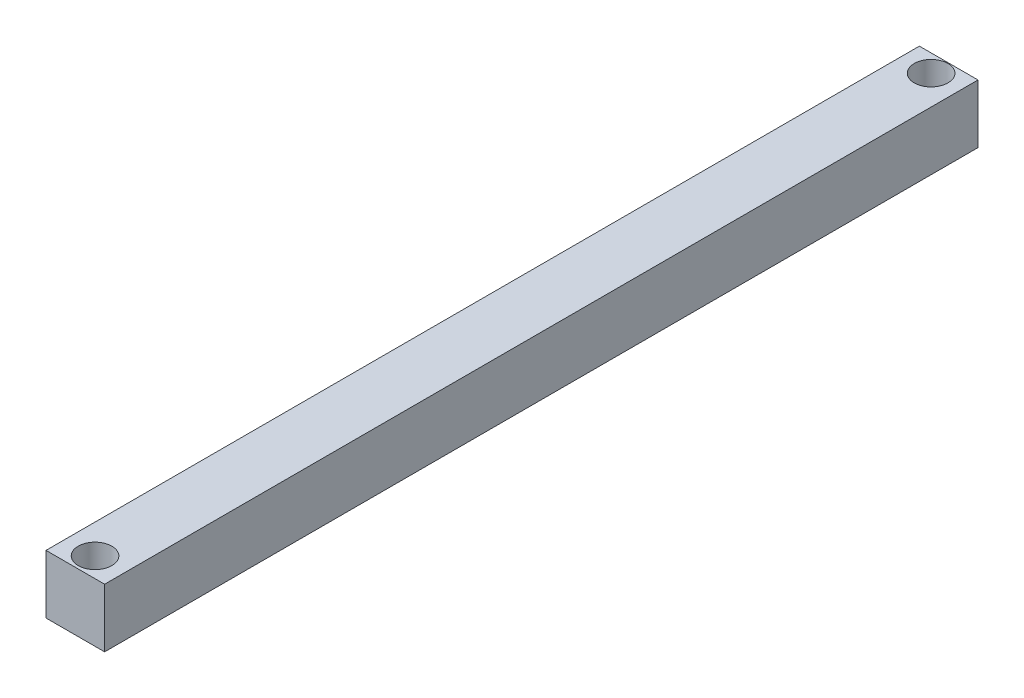
ISO-10303-21;
HEADER;
FILE_DESCRIPTION(('STEP AP214'),'2;1');
FILE_NAME('part.step','',(''),(''),'','','');
FILE_SCHEMA(('AUTOMOTIVE_DESIGN { 1 0 10303 214 1 1 1 1 }'));
ENDSEC;
DATA;
#1=APPLICATION_CONTEXT('core data for automotive mechanical design processes');
#2=APPLICATION_PROTOCOL_DEFINITION('international standard','automotive_design',2000,#1);
#3=PRODUCT_CONTEXT('',#1,'mechanical');
#4=PRODUCT('Part','Part','',(#3));
#5=PRODUCT_RELATED_PRODUCT_CATEGORY('part','',(#4));
#6=PRODUCT_DEFINITION_FORMATION('','',#4);
#7=PRODUCT_DEFINITION_CONTEXT('part definition',#1,'design');
#8=PRODUCT_DEFINITION('design','',#6,#7);
#9=PRODUCT_DEFINITION_SHAPE('','',#8);
#10=(LENGTH_UNIT() NAMED_UNIT(*) SI_UNIT(.MILLI.,.METRE.));
#11=(NAMED_UNIT(*) PLANE_ANGLE_UNIT() SI_UNIT($,.RADIAN.));
#12=(NAMED_UNIT(*) SI_UNIT($,.STERADIAN.) SOLID_ANGLE_UNIT());
#13=UNCERTAINTY_MEASURE_WITH_UNIT(LENGTH_MEASURE(1.E-05),#10,'distance_accuracy_value','');
#14=(GEOMETRIC_REPRESENTATION_CONTEXT(3) GLOBAL_UNCERTAINTY_ASSIGNED_CONTEXT((#13)) GLOBAL_UNIT_ASSIGNED_CONTEXT((#10,
#11,#12)) REPRESENTATION_CONTEXT('',''));
#15=CARTESIAN_POINT('',(0.,0.,0.));
#16=DIRECTION('',(0.,0.,1.));
#17=DIRECTION('',(1.,0.,0.));
#18=AXIS2_PLACEMENT_3D('',#15,#16,#17);
#19=CARTESIAN_POINT('',(9.99999999999998,20.,-149.));
#20=DIRECTION('',(-1.,0.,0.));
#21=DIRECTION('',(0.,0.,1.));
#22=AXIS2_PLACEMENT_3D('',#19,#20,#21);
#23=PLANE('',#22);
#24=DIRECTION('',(0.,0.,-1.));
#25=VECTOR('',#24,1.);
#26=CARTESIAN_POINT('',(9.99999999999998,0.,-149.));
#27=LINE('',#26,#25);
#28=CARTESIAN_POINT('',(10.,0.,149.));
#29=VERTEX_POINT('',#28);
#30=CARTESIAN_POINT('',(9.99999999999998,0.,-149.));
#31=VERTEX_POINT('',#30);
#32=EDGE_CURVE('E109',#29,#31,#27,.T.);
#33=ORIENTED_EDGE('',*,*,#32,.T.);
#34=DIRECTION('',(0.,-1.,0.));
#35=VECTOR('',#34,1.);
#36=CARTESIAN_POINT('',(9.99999999999998,20.,-149.));
#37=LINE('',#36,#35);
#38=CARTESIAN_POINT('',(9.99999999999998,20.,-149.));
#39=VERTEX_POINT('',#38);
#40=EDGE_CURVE('E11',#39,#31,#37,.T.);
#41=ORIENTED_EDGE('',*,*,#40,.F.);
#42=DIRECTION('',(0.,0.,-1.));
#43=VECTOR('',#42,1.);
#44=CARTESIAN_POINT('',(9.99999999999998,20.,-149.));
#45=LINE('',#44,#43);
#46=CARTESIAN_POINT('',(10.,20.,149.));
#47=VERTEX_POINT('',#46);
#48=EDGE_CURVE('E93',#47,#39,#45,.T.);
#49=ORIENTED_EDGE('',*,*,#48,.F.);
#50=DIRECTION('',(0.,-1.,0.));
#51=VECTOR('',#50,1.);
#52=CARTESIAN_POINT('',(10.,20.,149.));
#53=LINE('',#52,#51);
#54=EDGE_CURVE('E105',#47,#29,#53,.T.);
#55=ORIENTED_EDGE('',*,*,#54,.T.);
#56=EDGE_LOOP('',(#33,#41,#49,#55));
#57=FACE_BOUND('',#56,.T.);
#58=ADVANCED_FACE('F41',(#57),#23,.F.);
#59=CARTESIAN_POINT('',(-10.,20.,-149.));
#60=DIRECTION('',(0.,0.,1.));
#61=DIRECTION('',(1.,0.,0.));
#62=AXIS2_PLACEMENT_3D('',#59,#60,#61);
#63=PLANE('',#62);
#64=DIRECTION('',(-1.,0.,0.));
#65=VECTOR('',#64,1.);
#66=CARTESIAN_POINT('',(-10.,0.,-149.));
#67=LINE('',#66,#65);
#68=CARTESIAN_POINT('',(-10.,0.,-149.));
#69=VERTEX_POINT('',#68);
#70=EDGE_CURVE('E98',#31,#69,#67,.T.);
#71=ORIENTED_EDGE('',*,*,#70,.T.);
#72=DIRECTION('',(0.,-1.,0.));
#73=VECTOR('',#72,1.);
#74=CARTESIAN_POINT('',(-10.,20.,-149.));
#75=LINE('',#74,#73);
#76=CARTESIAN_POINT('',(-10.,20.,-149.));
#77=VERTEX_POINT('',#76);
#78=EDGE_CURVE('E50',#77,#69,#75,.T.);
#79=ORIENTED_EDGE('',*,*,#78,.F.);
#80=DIRECTION('',(-1.,0.,0.));
#81=VECTOR('',#80,1.);
#82=CARTESIAN_POINT('',(-10.,20.,-149.));
#83=LINE('',#82,#81);
#84=EDGE_CURVE('E88',#39,#77,#83,.T.);
#85=ORIENTED_EDGE('',*,*,#84,.F.);
#86=ORIENTED_EDGE('',*,*,#40,.T.);
#87=EDGE_LOOP('',(#71,#79,#85,#86));
#88=FACE_BOUND('',#87,.T.);
#89=ADVANCED_FACE('F97',(#88),#63,.F.);
#90=CARTESIAN_POINT('',(-10.,20.,-149.));
#91=DIRECTION('',(1.,0.,0.));
#92=DIRECTION('',(0.,0.,-1.));
#93=AXIS2_PLACEMENT_3D('',#90,#91,#92);
#94=PLANE('',#93);
#95=DIRECTION('',(0.,0.,1.));
#96=VECTOR('',#95,1.);
#97=CARTESIAN_POINT('',(-10.,0.,-149.));
#98=LINE('',#97,#96);
#99=CARTESIAN_POINT('',(-9.99999999999998,0.,149.));
#100=VERTEX_POINT('',#99);
#101=EDGE_CURVE('E75',#69,#100,#98,.T.);
#102=ORIENTED_EDGE('',*,*,#101,.T.);
#103=DIRECTION('',(0.,-1.,0.));
#104=VECTOR('',#103,1.);
#105=CARTESIAN_POINT('',(-9.99999999999998,20.,149.));
#106=LINE('',#105,#104);
#107=CARTESIAN_POINT('',(-9.99999999999998,20.,149.));
#108=VERTEX_POINT('',#107);
#109=EDGE_CURVE('E100',#108,#100,#106,.T.);
#110=ORIENTED_EDGE('',*,*,#109,.F.);
#111=DIRECTION('',(0.,0.,1.));
#112=VECTOR('',#111,1.);
#113=CARTESIAN_POINT('',(-10.,20.,-149.));
#114=LINE('',#113,#112);
#115=EDGE_CURVE('E91',#77,#108,#114,.T.);
#116=ORIENTED_EDGE('',*,*,#115,.F.);
#117=ORIENTED_EDGE('',*,*,#78,.T.);
#118=EDGE_LOOP('',(#102,#110,#116,#117));
#119=FACE_BOUND('',#118,.T.);
#120=ADVANCED_FACE('F101',(#119),#94,.F.);
#121=CARTESIAN_POINT('',(-9.99999999999998,20.,149.));
#122=DIRECTION('',(0.,0.,-1.));
#123=DIRECTION('',(-1.,0.,0.));
#124=AXIS2_PLACEMENT_3D('',#121,#122,#123);
#125=PLANE('',#124);
#126=DIRECTION('',(1.,0.,0.));
#127=VECTOR('',#126,1.);
#128=CARTESIAN_POINT('',(-9.99999999999998,0.,149.));
#129=LINE('',#128,#127);
#130=EDGE_CURVE('E81',#100,#29,#129,.T.);
#131=ORIENTED_EDGE('',*,*,#130,.T.);
#132=ORIENTED_EDGE('',*,*,#54,.F.);
#133=DIRECTION('',(1.,0.,0.));
#134=VECTOR('',#133,1.);
#135=CARTESIAN_POINT('',(-9.99999999999998,20.,149.));
#136=LINE('',#135,#134);
#137=EDGE_CURVE('E58',#108,#47,#136,.T.);
#138=ORIENTED_EDGE('',*,*,#137,.F.);
#139=ORIENTED_EDGE('',*,*,#109,.T.);
#140=EDGE_LOOP('',(#131,#132,#138,#139));
#141=FACE_BOUND('',#140,.T.);
#142=ADVANCED_FACE('F123',(#141),#125,.F.);
#143=CARTESIAN_POINT('',(0.,20.,0.));
#144=DIRECTION('',(0.,1.,0.));
#145=DIRECTION('',(0.,0.,1.));
#146=AXIS2_PLACEMENT_3D('',#143,#144,#145);
#147=PLANE('',#146);
#148=CARTESIAN_POINT('',(0.,20.,-143.));
#149=DIRECTION('',(0.,1.,0.));
#150=DIRECTION('',(0.,0.,1.));
#151=AXIS2_PLACEMENT_3D('',#148,#149,#150);
#152=CIRCLE('',#151,5.75000000000001);
#153=CARTESIAN_POINT('',(0.,20.,-137.25));
#154=VERTEX_POINT('',#153);
#155=EDGE_CURVE('E138',#154,#154,#152,.T.);
#156=ORIENTED_EDGE('',*,*,#155,.F.);
#157=EDGE_LOOP('',(#156));
#158=FACE_BOUND('',#157,.T.);
#159=CARTESIAN_POINT('',(0.,20.,142.27));
#160=DIRECTION('',(0.,1.,0.));
#161=DIRECTION('',(0.,0.,1.));
#162=AXIS2_PLACEMENT_3D('',#159,#160,#161);
#163=CIRCLE('',#162,5.75000000000001);
#164=CARTESIAN_POINT('',(0.,20.,148.02));
#165=VERTEX_POINT('',#164);
#166=EDGE_CURVE('E130',#165,#165,#163,.T.);
#167=ORIENTED_EDGE('',*,*,#166,.F.);
#168=EDGE_LOOP('',(#167));
#169=FACE_BOUND('',#168,.T.);
#170=ORIENTED_EDGE('',*,*,#48,.T.);
#171=ORIENTED_EDGE('',*,*,#84,.T.);
#172=ORIENTED_EDGE('',*,*,#115,.T.);
#173=ORIENTED_EDGE('',*,*,#137,.T.);
#174=EDGE_LOOP('',(#170,#171,#172,#173));
#175=FACE_BOUND('',#174,.T.);
#176=ADVANCED_FACE('F89',(#158,#169,#175),#147,.T.);
#177=CARTESIAN_POINT('',(0.,0.,0.));
#178=DIRECTION('',(0.,1.,0.));
#179=DIRECTION('',(0.,0.,1.));
#180=AXIS2_PLACEMENT_3D('',#177,#178,#179);
#181=PLANE('',#180);
#182=CARTESIAN_POINT('',(0.,0.,-143.));
#183=DIRECTION('',(0.,1.,0.));
#184=DIRECTION('',(0.,0.,1.));
#185=AXIS2_PLACEMENT_3D('',#182,#183,#184);
#186=CIRCLE('',#185,5.75000000000001);
#187=CARTESIAN_POINT('',(0.,0.,-137.25));
#188=VERTEX_POINT('',#187);
#189=EDGE_CURVE('E113',#188,#188,#186,.T.);
#190=ORIENTED_EDGE('',*,*,#189,.T.);
#191=EDGE_LOOP('',(#190));
#192=FACE_BOUND('',#191,.T.);
#193=CARTESIAN_POINT('',(0.,0.,142.27));
#194=DIRECTION('',(0.,1.,0.));
#195=DIRECTION('',(0.,0.,1.));
#196=AXIS2_PLACEMENT_3D('',#193,#194,#195);
#197=CIRCLE('',#196,5.75000000000001);
#198=CARTESIAN_POINT('',(0.,0.,148.02));
#199=VERTEX_POINT('',#198);
#200=EDGE_CURVE('E134',#199,#199,#197,.T.);
#201=ORIENTED_EDGE('',*,*,#200,.T.);
#202=EDGE_LOOP('',(#201));
#203=FACE_BOUND('',#202,.T.);
#204=ORIENTED_EDGE('',*,*,#32,.F.);
#205=ORIENTED_EDGE('',*,*,#130,.F.);
#206=ORIENTED_EDGE('',*,*,#101,.F.);
#207=ORIENTED_EDGE('',*,*,#70,.F.);
#208=EDGE_LOOP('',(#204,#205,#206,#207));
#209=FACE_BOUND('',#208,.T.);
#210=ADVANCED_FACE('F126',(#192,#203,#209),#181,.F.);
#211=CARTESIAN_POINT('',(0.,0.,142.27));
#212=DIRECTION('',(0.,1.,0.));
#213=DIRECTION('',(0.,0.,1.));
#214=AXIS2_PLACEMENT_3D('',#211,#212,#213);
#215=CYLINDRICAL_SURFACE('',#214,5.75000000000001);
#216=ORIENTED_EDGE('',*,*,#200,.F.);
#217=EDGE_LOOP('',(#216));
#218=FACE_BOUND('',#217,.T.);
#219=ORIENTED_EDGE('',*,*,#166,.T.);
#220=EDGE_LOOP('',(#219));
#221=FACE_BOUND('',#220,.T.);
#222=ADVANCED_FACE('F151',(#218,#221),#215,.F.);
#223=CARTESIAN_POINT('',(0.,0.,-143.));
#224=DIRECTION('',(0.,1.,0.));
#225=DIRECTION('',(0.,0.,1.));
#226=AXIS2_PLACEMENT_3D('',#223,#224,#225);
#227=CYLINDRICAL_SURFACE('',#226,5.75000000000001);
#228=ORIENTED_EDGE('',*,*,#189,.F.);
#229=EDGE_LOOP('',(#228));
#230=FACE_BOUND('',#229,.T.);
#231=ORIENTED_EDGE('',*,*,#155,.T.);
#232=EDGE_LOOP('',(#231));
#233=FACE_BOUND('',#232,.T.);
#234=ADVANCED_FACE('F148',(#230,#233),#227,.F.);
#235=CLOSED_SHELL('',(#58,#89,#120,#142,#176,#210,#222,#234));
#236=MANIFOLD_SOLID_BREP('B2',#235);
#237=ADVANCED_BREP_SHAPE_REPRESENTATION('',(#18,#236),#14);
#238=SHAPE_DEFINITION_REPRESENTATION(#9,#237);
ENDSEC;
END-ISO-10303-21;
